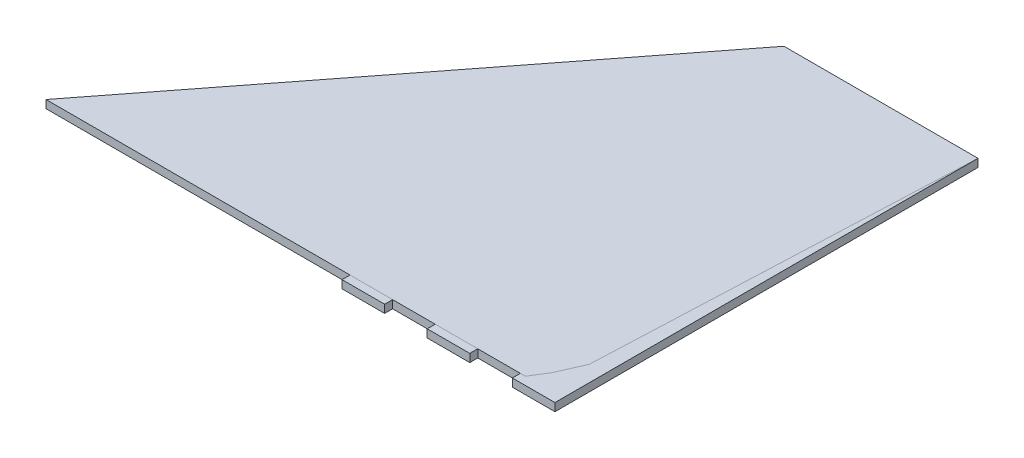
ISO-10303-21;
HEADER;
FILE_DESCRIPTION(('STEP AP214'),'2;1');
FILE_NAME('part.step','',(''),(''),'','','');
FILE_SCHEMA(('AUTOMOTIVE_DESIGN { 1 0 10303 214 1 1 1 1 }'));
ENDSEC;
DATA;
#1=APPLICATION_CONTEXT('core data for automotive mechanical design processes');
#2=APPLICATION_PROTOCOL_DEFINITION('international standard','automotive_design',2000,#1);
#3=PRODUCT_CONTEXT('',#1,'mechanical');
#4=PRODUCT('Part','Part','',(#3));
#5=PRODUCT_RELATED_PRODUCT_CATEGORY('part','',(#4));
#6=PRODUCT_DEFINITION_FORMATION('','',#4);
#7=PRODUCT_DEFINITION_CONTEXT('part definition',#1,'design');
#8=PRODUCT_DEFINITION('design','',#6,#7);
#9=PRODUCT_DEFINITION_SHAPE('','',#8);
#10=(LENGTH_UNIT() NAMED_UNIT(*) SI_UNIT(.MILLI.,.METRE.));
#11=(NAMED_UNIT(*) PLANE_ANGLE_UNIT() SI_UNIT($,.RADIAN.));
#12=(NAMED_UNIT(*) SI_UNIT($,.STERADIAN.) SOLID_ANGLE_UNIT());
#13=UNCERTAINTY_MEASURE_WITH_UNIT(LENGTH_MEASURE(1.E-05),#10,'distance_accuracy_value','');
#14=(GEOMETRIC_REPRESENTATION_CONTEXT(3) GLOBAL_UNCERTAINTY_ASSIGNED_CONTEXT((#13)) GLOBAL_UNIT_ASSIGNED_CONTEXT((#10,
#11,#12)) REPRESENTATION_CONTEXT('',''));
#15=CARTESIAN_POINT('',(0.,0.,0.));
#16=DIRECTION('',(0.,0.,1.));
#17=DIRECTION('',(1.,0.,0.));
#18=AXIS2_PLACEMENT_3D('',#15,#16,#17);
#19=CARTESIAN_POINT('',(0.,0.,0.));
#20=DIRECTION('',(0.,1.,0.));
#21=DIRECTION('',(0.,0.,1.));
#22=AXIS2_PLACEMENT_3D('',#19,#20,#21);
#23=PLANE('',#22);
#24=DIRECTION('',(-1.,0.,0.));
#25=VECTOR('',#24,1.);
#26=CARTESIAN_POINT('',(288.925,0.,9.52500000000002));
#27=LINE('',#26,#25);
#28=CARTESIAN_POINT('',(288.925,0.,9.52500000000002));
#29=VERTEX_POINT('',#28);
#30=CARTESIAN_POINT('',(-19.4751899156325,0.,9.52499999999998));
#31=VERTEX_POINT('',#30);
#32=EDGE_CURVE('E139',#29,#31,#27,.T.);
#33=ORIENTED_EDGE('',*,*,#32,.T.);
#34=DIRECTION('',(0.61394061351492,0.,-0.789352217376326));
#35=VECTOR('',#34,1.);
#36=CARTESIAN_POINT('',(-19.4751899156325,0.,9.52499999999998));
#37=LINE('',#36,#35);
#38=CARTESIAN_POINT('',(173.141476751034,0.,-238.125));
#39=VERTEX_POINT('',#38);
#40=EDGE_CURVE('E150',#31,#39,#37,.T.);
#41=ORIENTED_EDGE('',*,*,#40,.T.);
#42=DIRECTION('',(1.,0.,0.));
#43=VECTOR('',#42,1.);
#44=CARTESIAN_POINT('',(173.141476751034,0.,-238.125));
#45=LINE('',#44,#43);
#46=CARTESIAN_POINT('',(288.925,0.,-238.125));
#47=VERTEX_POINT('',#46);
#48=EDGE_CURVE('E135',#39,#47,#45,.T.);
#49=ORIENTED_EDGE('',*,*,#48,.T.);
#50=DIRECTION('',(0.,0.,1.));
#51=VECTOR('',#50,1.);
#52=CARTESIAN_POINT('',(288.925,0.,-238.125));
#53=LINE('',#52,#51);
#54=EDGE_CURVE('E13',#47,#29,#53,.T.);
#55=ORIENTED_EDGE('',*,*,#54,.T.);
#56=EDGE_LOOP('',(#33,#41,#49,#55));
#57=FACE_BOUND('',#56,.T.);
#58=ADVANCED_FACE('F130',(#57),#23,.F.);
#59=OPEN_SHELL('',(#58));
#60=SHELL_BASED_SURFACE_MODEL('B2',(#59));
#61=CARTESIAN_POINT('',(0.,4.7625,0.));
#62=DIRECTION('',(0.,1.,0.));
#63=DIRECTION('',(0.,0.,1.));
#64=AXIS2_PLACEMENT_3D('',#61,#62,#63);
#65=PLANE('',#64);
#66=DIRECTION('',(-0.61394061351492,0.,0.789352217376326));
#67=VECTOR('',#66,1.);
#68=CARTESIAN_POINT('',(173.141476751034,4.7625,-238.125));
#69=LINE('',#68,#67);
#70=CARTESIAN_POINT('',(173.141476751034,4.7625,-238.125));
#71=VERTEX_POINT('',#70);
#72=CARTESIAN_POINT('',(-19.4751899156325,4.7625,9.52499999999998));
#73=VERTEX_POINT('',#72);
#74=EDGE_CURVE('E192',#71,#73,#69,.T.);
#75=ORIENTED_EDGE('',*,*,#74,.T.);
#76=DIRECTION('',(1.,0.,0.));
#77=VECTOR('',#76,1.);
#78=CARTESIAN_POINT('',(-19.4751899156325,4.7625,9.52499999999998));
#79=LINE('',#78,#77);
#80=CARTESIAN_POINT('',(288.925,4.7625,9.52499999999998));
#81=VERTEX_POINT('',#80);
#82=EDGE_CURVE('E203',#73,#81,#79,.T.);
#83=ORIENTED_EDGE('',*,*,#82,.T.);
#84=DIRECTION('',(0.,0.,-1.));
#85=VECTOR('',#84,1.);
#86=CARTESIAN_POINT('',(288.925,4.7625,9.52499999999998));
#87=LINE('',#86,#85);
#88=CARTESIAN_POINT('',(288.925,4.7625,-238.125));
#89=VERTEX_POINT('',#88);
#90=EDGE_CURVE('E188',#81,#89,#87,.T.);
#91=ORIENTED_EDGE('',*,*,#90,.T.);
#92=DIRECTION('',(-1.,0.,0.));
#93=VECTOR('',#92,1.);
#94=CARTESIAN_POINT('',(288.925,4.7625,-238.125));
#95=LINE('',#94,#93);
#96=EDGE_CURVE('E128',#89,#71,#95,.T.);
#97=ORIENTED_EDGE('',*,*,#96,.T.);
#98=EDGE_LOOP('',(#75,#83,#91,#97));
#99=FACE_BOUND('',#98,.T.);
#100=ADVANCED_FACE('F183',(#99),#65,.T.);
#101=OPEN_SHELL('',(#100));
#102=SHELL_BASED_SURFACE_MODEL('B7',(#101));
#103=CARTESIAN_POINT('',(0.,4.7625,-238.125));
#104=DIRECTION('',(0.,0.,-1.));
#105=DIRECTION('',(-1.,0.,0.));
#106=AXIS2_PLACEMENT_3D('',#103,#104,#105);
#107=PLANE('',#106);
#108=DIRECTION('',(1.,0.,0.));
#109=VECTOR('',#108,1.);
#110=CARTESIAN_POINT('',(0.,0.,-238.125));
#111=LINE('',#110,#109);
#112=CARTESIAN_POINT('',(173.141476751034,0.,-238.125));
#113=VERTEX_POINT('',#112);
#114=CARTESIAN_POINT('',(288.925,0.,-238.125));
#115=VERTEX_POINT('',#114);
#116=EDGE_CURVE('E445',#113,#115,#111,.T.);
#117=ORIENTED_EDGE('',*,*,#116,.F.);
#118=DIRECTION('',(0.,-1.,0.));
#119=VECTOR('',#118,1.);
#120=CARTESIAN_POINT('',(173.141476751034,4.7625,-238.125));
#121=LINE('',#120,#119);
#122=CARTESIAN_POINT('',(173.141476751034,4.7625,-238.125));
#123=VERTEX_POINT('',#122);
#124=EDGE_CURVE('E325',#123,#113,#121,.T.);
#125=ORIENTED_EDGE('',*,*,#124,.F.);
#126=DIRECTION('',(1.,0.,0.));
#127=VECTOR('',#126,1.);
#128=CARTESIAN_POINT('',(0.,4.7625,-238.125));
#129=LINE('',#128,#127);
#130=CARTESIAN_POINT('',(288.925,4.7625,-238.125));
#131=VERTEX_POINT('',#130);
#132=EDGE_CURVE('E412',#123,#131,#129,.T.);
#133=ORIENTED_EDGE('',*,*,#132,.T.);
#134=DIRECTION('',(0.,-1.,0.));
#135=VECTOR('',#134,1.);
#136=CARTESIAN_POINT('',(288.925,4.7625,-238.125));
#137=LINE('',#136,#135);
#138=EDGE_CURVE('E320',#131,#115,#137,.T.);
#139=ORIENTED_EDGE('',*,*,#138,.T.);
#140=EDGE_LOOP('',(#117,#125,#133,#139));
#141=FACE_BOUND('',#140,.T.);
#142=ADVANCED_FACE('F227',(#141),#107,.T.);
#143=CARTESIAN_POINT('',(288.925,4.7625,0.));
#144=DIRECTION('',(-1.,0.,0.));
#145=DIRECTION('',(0.,0.,1.));
#146=AXIS2_PLACEMENT_3D('',#143,#144,#145);
#147=PLANE('',#146);
#148=DIRECTION('',(0.,0.,-1.));
#149=VECTOR('',#148,1.);
#150=CARTESIAN_POINT('',(288.925,0.,0.));
#151=LINE('',#150,#149);
#152=CARTESIAN_POINT('',(288.925,0.,14.2874999999999));
#153=VERTEX_POINT('',#152);
#154=EDGE_CURVE('E287',#153,#115,#151,.T.);
#155=ORIENTED_EDGE('',*,*,#154,.T.);
#156=ORIENTED_EDGE('',*,*,#138,.F.);
#157=DIRECTION('',(0.,0.,-1.));
#158=VECTOR('',#157,1.);
#159=CARTESIAN_POINT('',(288.925,4.7625,0.));
#160=LINE('',#159,#158);
#161=CARTESIAN_POINT('',(288.925,4.7625,14.2874999999999));
#162=VERTEX_POINT('',#161);
#163=EDGE_CURVE('E406',#162,#131,#160,.T.);
#164=ORIENTED_EDGE('',*,*,#163,.F.);
#165=DIRECTION('',(0.,-1.,0.));
#166=VECTOR('',#165,1.);
#167=CARTESIAN_POINT('',(288.925,4.7625,14.2874999999999));
#168=LINE('',#167,#166);
#169=EDGE_CURVE('E231',#162,#153,#168,.T.);
#170=ORIENTED_EDGE('',*,*,#169,.T.);
#171=EDGE_LOOP('',(#155,#156,#164,#170));
#172=FACE_BOUND('',#171,.T.);
#173=ADVANCED_FACE('F404',(#172),#147,.F.);
#174=CARTESIAN_POINT('',(0.,4.7625,0.));
#175=DIRECTION('',(0.,0.,-1.));
#176=DIRECTION('',(-1.,0.,0.));
#177=AXIS2_PLACEMENT_3D('',#174,#175,#176);
#178=PLANE('',#177);
#179=DIRECTION('',(1.,0.,0.));
#180=VECTOR('',#179,1.);
#181=CARTESIAN_POINT('',(0.,0.,0.));
#182=LINE('',#181,#180);
#183=CARTESIAN_POINT('',(0.,0.,0.));
#184=VERTEX_POINT('',#183);
#185=CARTESIAN_POINT('',(272.451083662066,0.,0.));
#186=VERTEX_POINT('',#185);
#187=EDGE_CURVE('E441',#184,#186,#182,.T.);
#188=ORIENTED_EDGE('',*,*,#187,.F.);
#189=DIRECTION('',(0.,-1.,0.));
#190=VECTOR('',#189,1.);
#191=CARTESIAN_POINT('',(0.,4.7625,0.));
#192=LINE('',#191,#190);
#193=CARTESIAN_POINT('',(0.,4.7625,0.));
#194=VERTEX_POINT('',#193);
#195=EDGE_CURVE('E337',#194,#184,#192,.T.);
#196=ORIENTED_EDGE('',*,*,#195,.F.);
#197=DIRECTION('',(1.,0.,0.));
#198=VECTOR('',#197,1.);
#199=CARTESIAN_POINT('',(0.,4.7625,0.));
#200=LINE('',#199,#198);
#201=CARTESIAN_POINT('',(272.451083662066,4.7625,0.));
#202=VERTEX_POINT('',#201);
#203=EDGE_CURVE('E415',#194,#202,#200,.T.);
#204=ORIENTED_EDGE('',*,*,#203,.T.);
#205=DIRECTION('',(0.,-1.,0.));
#206=VECTOR('',#205,1.);
#207=CARTESIAN_POINT('',(272.451083662066,4.7625,0.));
#208=LINE('',#207,#206);
#209=EDGE_CURVE('E340',#202,#186,#208,.T.);
#210=ORIENTED_EDGE('',*,*,#209,.T.);
#211=EDGE_LOOP('',(#188,#196,#204,#210));
#212=FACE_BOUND('',#211,.T.);
#213=ADVANCED_FACE('F558',(#212),#178,.T.);
#214=CARTESIAN_POINT('',(227.510698728117,4.7625,-101.115866101385));
#215=DIRECTION('',(0.913811548620257,0.,-0.406138466053448));
#216=DIRECTION('',(-0.406138466053448,0.,-0.913811548620257));
#217=AXIS2_PLACEMENT_3D('',#214,#215,#216);
#218=PLANE('',#217);
#219=DIRECTION('',(0.406138466053448,0.,0.913811548620257));
#220=VECTOR('',#219,1.);
#221=CARTESIAN_POINT('',(227.510698728117,0.,-101.115866101385));
#222=LINE('',#221,#220);
#223=CARTESIAN_POINT('',(173.377962330406,0.,-222.914522996236));
#224=VERTEX_POINT('',#223);
#225=EDGE_CURVE('E438',#224,#186,#222,.T.);
#226=ORIENTED_EDGE('',*,*,#225,.T.);
#227=ORIENTED_EDGE('',*,*,#209,.F.);
#228=DIRECTION('',(0.406138466053448,0.,0.913811548620257));
#229=VECTOR('',#228,1.);
#230=CARTESIAN_POINT('',(227.510698728117,4.7625,-101.115866101385));
#231=LINE('',#230,#229);
#232=CARTESIAN_POINT('',(173.377962330406,4.7625,-222.914522996236));
#233=VERTEX_POINT('',#232);
#234=EDGE_CURVE('E593',#233,#202,#231,.T.);
#235=ORIENTED_EDGE('',*,*,#234,.F.);
#236=DIRECTION('',(0.,-1.,0.));
#237=VECTOR('',#236,1.);
#238=CARTESIAN_POINT('',(173.377962330406,4.7625,-222.914522996236));
#239=LINE('',#238,#237);
#240=EDGE_CURVE('E344',#233,#224,#239,.T.);
#241=ORIENTED_EDGE('',*,*,#240,.T.);
#242=EDGE_LOOP('',(#226,#227,#235,#241));
#243=FACE_BOUND('',#242,.T.);
#244=ADVANCED_FACE('F554',(#243),#218,.F.);
#245=CARTESIAN_POINT('',(0.,4.7625,0.));
#246=DIRECTION('',(-0.789352217376326,0.,-0.61394061351492));
#247=DIRECTION('',(-0.61394061351492,0.,0.789352217376327));
#248=AXIS2_PLACEMENT_3D('',#245,#246,#247);
#249=PLANE('',#248);
#250=DIRECTION('',(0.61394061351492,0.,-0.789352217376327));
#251=VECTOR('',#250,1.);
#252=CARTESIAN_POINT('',(0.,0.,0.));
#253=LINE('',#252,#251);
#254=EDGE_CURVE('E435',#184,#224,#253,.T.);
#255=ORIENTED_EDGE('',*,*,#254,.T.);
#256=ORIENTED_EDGE('',*,*,#240,.F.);
#257=DIRECTION('',(0.61394061351492,0.,-0.789352217376327));
#258=VECTOR('',#257,1.);
#259=CARTESIAN_POINT('',(0.,4.7625,0.));
#260=LINE('',#259,#258);
#261=EDGE_CURVE('E589',#194,#233,#260,.T.);
#262=ORIENTED_EDGE('',*,*,#261,.F.);
#263=ORIENTED_EDGE('',*,*,#195,.T.);
#264=EDGE_LOOP('',(#255,#256,#262,#263));
#265=FACE_BOUND('',#264,.T.);
#266=ADVANCED_FACE('F550',(#265),#249,.F.);
#267=CARTESIAN_POINT('',(279.4,4.7625,0.));
#268=DIRECTION('',(-1.,0.,0.));
#269=DIRECTION('',(0.,0.,1.));
#270=AXIS2_PLACEMENT_3D('',#267,#268,#269);
#271=PLANE('',#270);
#272=DIRECTION('',(0.,0.,-1.));
#273=VECTOR('',#272,1.);
#274=CARTESIAN_POINT('',(279.4,0.,0.));
#275=LINE('',#274,#273);
#276=CARTESIAN_POINT('',(279.4,0.,-15.6350617603514));
#277=VERTEX_POINT('',#276);
#278=CARTESIAN_POINT('',(279.4,0.,-228.6));
#279=VERTEX_POINT('',#278);
#280=EDGE_CURVE('E432',#277,#279,#275,.T.);
#281=ORIENTED_EDGE('',*,*,#280,.F.);
#282=DIRECTION('',(0.,-1.,0.));
#283=VECTOR('',#282,1.);
#284=CARTESIAN_POINT('',(279.4,4.7625,-15.6350617603514));
#285=LINE('',#284,#283);
#286=CARTESIAN_POINT('',(279.4,4.7625,-15.6350617603514));
#287=VERTEX_POINT('',#286);
#288=EDGE_CURVE('E347',#287,#277,#285,.T.);
#289=ORIENTED_EDGE('',*,*,#288,.F.);
#290=DIRECTION('',(0.,0.,-1.));
#291=VECTOR('',#290,1.);
#292=CARTESIAN_POINT('',(279.4,4.7625,0.));
#293=LINE('',#292,#291);
#294=CARTESIAN_POINT('',(279.4,4.7625,-228.6));
#295=VERTEX_POINT('',#294);
#296=EDGE_CURVE('E598',#287,#295,#293,.T.);
#297=ORIENTED_EDGE('',*,*,#296,.T.);
#298=DIRECTION('',(0.,-1.,0.));
#299=VECTOR('',#298,1.);
#300=CARTESIAN_POINT('',(279.4,4.7625,-228.6));
#301=LINE('',#300,#299);
#302=EDGE_CURVE('E350',#295,#279,#301,.T.);
#303=ORIENTED_EDGE('',*,*,#302,.T.);
#304=EDGE_LOOP('',(#281,#289,#297,#303));
#305=FACE_BOUND('',#304,.T.);
#306=ADVANCED_FACE('F546',(#305),#271,.T.);
#307=CARTESIAN_POINT('',(1.87350135405495E-13,4.7625,-228.6));
#308=DIRECTION('',(0.,0.,1.));
#309=DIRECTION('',(1.,0.,0.));
#310=AXIS2_PLACEMENT_3D('',#307,#308,#309);
#311=PLANE('',#310);
#312=DIRECTION('',(-1.,0.,0.));
#313=VECTOR('',#312,1.);
#314=CARTESIAN_POINT('',(1.87350135405495E-13,0.,-228.6));
#315=LINE('',#314,#313);
#316=CARTESIAN_POINT('',(184.748916337934,0.,-228.6));
#317=VERTEX_POINT('',#316);
#318=EDGE_CURVE('E429',#279,#317,#315,.T.);
#319=ORIENTED_EDGE('',*,*,#318,.F.);
#320=ORIENTED_EDGE('',*,*,#302,.F.);
#321=DIRECTION('',(-1.,0.,0.));
#322=VECTOR('',#321,1.);
#323=CARTESIAN_POINT('',(1.87350135405495E-13,4.7625,-228.6));
#324=LINE('',#323,#322);
#325=CARTESIAN_POINT('',(184.748916337934,4.7625,-228.6));
#326=VERTEX_POINT('',#325);
#327=EDGE_CURVE('E510',#295,#326,#324,.T.);
#328=ORIENTED_EDGE('',*,*,#327,.T.);
#329=DIRECTION('',(0.,-1.,0.));
#330=VECTOR('',#329,1.);
#331=CARTESIAN_POINT('',(184.748916337934,4.7625,-228.6));
#332=LINE('',#331,#330);
#333=EDGE_CURVE('E341',#326,#317,#332,.T.);
#334=ORIENTED_EDGE('',*,*,#333,.T.);
#335=EDGE_LOOP('',(#319,#320,#328,#334));
#336=FACE_BOUND('',#335,.T.);
#337=ADVANCED_FACE('F542',(#336),#311,.T.);
#338=CARTESIAN_POINT('',(239.116105395594,4.7625,-106.273824620264));
#339=DIRECTION('',(0.913811548620257,0.,-0.406138466053447));
#340=DIRECTION('',(-0.406138466053447,0.,-0.913811548620257));
#341=AXIS2_PLACEMENT_3D('',#338,#339,#340);
#342=PLANE('',#341);
#343=DIRECTION('',(0.406138466053447,0.,0.913811548620257));
#344=VECTOR('',#343,1.);
#345=CARTESIAN_POINT('',(239.116105395594,0.,-106.273824620264));
#346=LINE('',#345,#344);
#347=EDGE_CURVE('E379',#317,#277,#346,.T.);
#348=ORIENTED_EDGE('',*,*,#347,.F.);
#349=ORIENTED_EDGE('',*,*,#333,.F.);
#350=DIRECTION('',(0.406138466053447,0.,0.913811548620257));
#351=VECTOR('',#350,1.);
#352=CARTESIAN_POINT('',(239.116105395594,4.7625,-106.273824620264));
#353=LINE('',#352,#351);
#354=EDGE_CURVE('E508',#326,#287,#353,.T.);
#355=ORIENTED_EDGE('',*,*,#354,.T.);
#356=ORIENTED_EDGE('',*,*,#288,.T.);
#357=EDGE_LOOP('',(#348,#349,#355,#356));
#358=FACE_BOUND('',#357,.T.);
#359=ADVANCED_FACE('F539',(#358),#342,.T.);
#360=CARTESIAN_POINT('',(-7.51857987050951,4.7625,-5.84778434372962));
#361=DIRECTION('',(0.789352217376326,0.,0.61394061351492));
#362=DIRECTION('',(0.61394061351492,0.,-0.789352217376327));
#363=AXIS2_PLACEMENT_3D('',#360,#361,#362);
#364=PLANE('',#363);
#365=DIRECTION('',(-0.61394061351492,0.,0.789352217376327));
#366=VECTOR('',#365,1.);
#367=CARTESIAN_POINT('',(-7.51857987050951,0.,-5.84778434372962));
#368=LINE('',#367,#366);
#369=CARTESIAN_POINT('',(-19.4751899156325,0.,9.52499999999998));
#370=VERTEX_POINT('',#369);
#371=EDGE_CURVE('E447',#113,#370,#368,.T.);
#372=ORIENTED_EDGE('',*,*,#371,.T.);
#373=DIRECTION('',(0.,-1.,0.));
#374=VECTOR('',#373,1.);
#375=CARTESIAN_POINT('',(-19.4751899156325,4.7625,9.52499999999998));
#376=LINE('',#375,#374);
#377=CARTESIAN_POINT('',(-19.4751899156325,4.7625,9.52499999999998));
#378=VERTEX_POINT('',#377);
#379=EDGE_CURVE('E333',#378,#370,#376,.T.);
#380=ORIENTED_EDGE('',*,*,#379,.F.);
#381=DIRECTION('',(-0.61394061351492,0.,0.789352217376327));
#382=VECTOR('',#381,1.);
#383=CARTESIAN_POINT('',(-7.51857987050951,4.7625,-5.84778434372962));
#384=LINE('',#383,#382);
#385=EDGE_CURVE('E419',#123,#378,#384,.T.);
#386=ORIENTED_EDGE('',*,*,#385,.F.);
#387=ORIENTED_EDGE('',*,*,#124,.T.);
#388=EDGE_LOOP('',(#372,#380,#386,#387));
#389=FACE_BOUND('',#388,.T.);
#390=ADVANCED_FACE('F466',(#389),#364,.F.);
#391=CARTESIAN_POINT('',(0.,0.,0.));
#392=DIRECTION('',(0.,1.,0.));
#393=DIRECTION('',(0.,0.,1.));
#394=AXIS2_PLACEMENT_3D('',#391,#392,#393);
#395=PLANE('',#394);
#396=ORIENTED_EDGE('',*,*,#347,.T.);
#397=ORIENTED_EDGE('',*,*,#280,.T.);
#398=ORIENTED_EDGE('',*,*,#318,.T.);
#399=EDGE_LOOP('',(#396,#397,#398));
#400=FACE_BOUND('',#399,.T.);
#401=ORIENTED_EDGE('',*,*,#254,.F.);
#402=ORIENTED_EDGE('',*,*,#187,.T.);
#403=ORIENTED_EDGE('',*,*,#225,.F.);
#404=EDGE_LOOP('',(#401,#402,#403));
#405=FACE_BOUND('',#404,.T.);
#406=ORIENTED_EDGE('',*,*,#154,.F.);
#407=DIRECTION('',(-1.,0.,0.));
#408=VECTOR('',#407,1.);
#409=CARTESIAN_POINT('',(288.925,0.,14.2874999999999));
#410=LINE('',#409,#408);
#411=CARTESIAN_POINT('',(263.525,0.,14.2874999999999));
#412=VERTEX_POINT('',#411);
#413=EDGE_CURVE('E297',#153,#412,#410,.T.);
#414=ORIENTED_EDGE('',*,*,#413,.T.);
#415=DIRECTION('',(0.,0.,1.));
#416=VECTOR('',#415,1.);
#417=CARTESIAN_POINT('',(263.525,0.,9.52499999999994));
#418=LINE('',#417,#416);
#419=CARTESIAN_POINT('',(263.525,0.,9.52499999999994));
#420=VERTEX_POINT('',#419);
#421=EDGE_CURVE('E305',#420,#412,#418,.T.);
#422=ORIENTED_EDGE('',*,*,#421,.F.);
#423=DIRECTION('',(-1.,0.,0.));
#424=VECTOR('',#423,1.);
#425=CARTESIAN_POINT('',(0.,0.,9.52499999999997));
#426=LINE('',#425,#424);
#427=CARTESIAN_POINT('',(238.125,0.,9.52499999999994));
#428=VERTEX_POINT('',#427);
#429=EDGE_CURVE('E453',#420,#428,#426,.T.);
#430=ORIENTED_EDGE('',*,*,#429,.T.);
#431=DIRECTION('',(0.,0.,1.));
#432=VECTOR('',#431,1.);
#433=CARTESIAN_POINT('',(238.125,0.,9.52499999999994));
#434=LINE('',#433,#432);
#435=CARTESIAN_POINT('',(238.125,0.,14.2874999999999));
#436=VERTEX_POINT('',#435);
#437=EDGE_CURVE('E302',#428,#436,#434,.T.);
#438=ORIENTED_EDGE('',*,*,#437,.T.);
#439=DIRECTION('',(-1.,0.,0.));
#440=VECTOR('',#439,1.);
#441=CARTESIAN_POINT('',(238.125,0.,14.2874999999999));
#442=LINE('',#441,#440);
#443=CARTESIAN_POINT('',(212.725,0.,14.2874999999999));
#444=VERTEX_POINT('',#443);
#445=EDGE_CURVE('E393',#436,#444,#442,.T.);
#446=ORIENTED_EDGE('',*,*,#445,.T.);
#447=DIRECTION('',(0.,0.,1.));
#448=VECTOR('',#447,1.);
#449=CARTESIAN_POINT('',(212.725,0.,9.52499999999995));
#450=LINE('',#449,#448);
#451=CARTESIAN_POINT('',(212.725,0.,9.52499999999995));
#452=VERTEX_POINT('',#451);
#453=EDGE_CURVE('E385',#452,#444,#450,.T.);
#454=ORIENTED_EDGE('',*,*,#453,.F.);
#455=CARTESIAN_POINT('',(187.325,0.,9.52499999999995));
#456=VERTEX_POINT('',#455);
#457=EDGE_CURVE('E452',#452,#456,#426,.T.);
#458=ORIENTED_EDGE('',*,*,#457,.T.);
#459=DIRECTION('',(0.,0.,1.));
#460=VECTOR('',#459,1.);
#461=CARTESIAN_POINT('',(187.325,0.,9.52499999999995));
#462=LINE('',#461,#460);
#463=CARTESIAN_POINT('',(187.325,0.,14.2875));
#464=VERTEX_POINT('',#463);
#465=EDGE_CURVE('E366',#456,#464,#462,.T.);
#466=ORIENTED_EDGE('',*,*,#465,.T.);
#467=DIRECTION('',(-1.,0.,0.));
#468=VECTOR('',#467,1.);
#469=CARTESIAN_POINT('',(187.325,0.,14.2875));
#470=LINE('',#469,#468);
#471=CARTESIAN_POINT('',(161.925,0.,14.2875));
#472=VERTEX_POINT('',#471);
#473=EDGE_CURVE('E369',#464,#472,#470,.T.);
#474=ORIENTED_EDGE('',*,*,#473,.T.);
#475=DIRECTION('',(0.,0.,1.));
#476=VECTOR('',#475,1.);
#477=CARTESIAN_POINT('',(161.925,0.,9.52499999999996));
#478=LINE('',#477,#476);
#479=CARTESIAN_POINT('',(161.925,0.,9.52499999999995));
#480=VERTEX_POINT('',#479);
#481=EDGE_CURVE('E360',#480,#472,#478,.T.);
#482=ORIENTED_EDGE('',*,*,#481,.F.);
#483=EDGE_CURVE('E450',#480,#370,#426,.T.);
#484=ORIENTED_EDGE('',*,*,#483,.T.);
#485=ORIENTED_EDGE('',*,*,#371,.F.);
#486=ORIENTED_EDGE('',*,*,#116,.T.);
#487=EDGE_LOOP('',(#406,#414,#422,#430,#438,#446,#454,#458,#466,#474,#482,#484,#485,#486));
#488=FACE_BOUND('',#487,.T.);
#489=ADVANCED_FACE('F313',(#400,#405,#488),#395,.F.);
#490=CARTESIAN_POINT('',(0.,4.7625,0.));
#491=DIRECTION('',(0.,1.,0.));
#492=DIRECTION('',(0.,0.,1.));
#493=AXIS2_PLACEMENT_3D('',#490,#491,#492);
#494=PLANE('',#493);
#495=ORIENTED_EDGE('',*,*,#354,.F.);
#496=ORIENTED_EDGE('',*,*,#327,.F.);
#497=ORIENTED_EDGE('',*,*,#296,.F.);
#498=EDGE_LOOP('',(#495,#496,#497));
#499=FACE_BOUND('',#498,.T.);
#500=ORIENTED_EDGE('',*,*,#261,.T.);
#501=ORIENTED_EDGE('',*,*,#234,.T.);
#502=ORIENTED_EDGE('',*,*,#203,.F.);
#503=EDGE_LOOP('',(#500,#501,#502));
#504=FACE_BOUND('',#503,.T.);
#505=ORIENTED_EDGE('',*,*,#163,.T.);
#506=ORIENTED_EDGE('',*,*,#132,.F.);
#507=ORIENTED_EDGE('',*,*,#385,.T.);
#508=DIRECTION('',(-1.,0.,0.));
#509=VECTOR('',#508,1.);
#510=CARTESIAN_POINT('',(0.,4.7625,9.52499999999997));
#511=LINE('',#510,#509);
#512=CARTESIAN_POINT('',(161.925,4.7625,9.52499999999995));
#513=VERTEX_POINT('',#512);
#514=EDGE_CURVE('E421',#513,#378,#511,.T.);
#515=ORIENTED_EDGE('',*,*,#514,.F.);
#516=DIRECTION('',(0.,0.,1.));
#517=VECTOR('',#516,1.);
#518=CARTESIAN_POINT('',(161.925,4.7625,9.52499999999996));
#519=LINE('',#518,#517);
#520=CARTESIAN_POINT('',(161.925,4.7625,14.2875));
#521=VERTEX_POINT('',#520);
#522=EDGE_CURVE('E363',#513,#521,#519,.T.);
#523=ORIENTED_EDGE('',*,*,#522,.T.);
#524=DIRECTION('',(-1.,0.,0.));
#525=VECTOR('',#524,1.);
#526=CARTESIAN_POINT('',(187.325,4.7625,14.2875));
#527=LINE('',#526,#525);
#528=CARTESIAN_POINT('',(187.325,4.7625,14.2875));
#529=VERTEX_POINT('',#528);
#530=EDGE_CURVE('E359',#529,#521,#527,.T.);
#531=ORIENTED_EDGE('',*,*,#530,.F.);
#532=DIRECTION('',(0.,0.,1.));
#533=VECTOR('',#532,1.);
#534=CARTESIAN_POINT('',(187.325,4.7625,9.52499999999995));
#535=LINE('',#534,#533);
#536=CARTESIAN_POINT('',(187.325,4.7625,9.52499999999995));
#537=VERTEX_POINT('',#536);
#538=EDGE_CURVE('E356',#537,#529,#535,.T.);
#539=ORIENTED_EDGE('',*,*,#538,.F.);
#540=CARTESIAN_POINT('',(212.725,4.7625,9.52499999999995));
#541=VERTEX_POINT('',#540);
#542=EDGE_CURVE('E426',#541,#537,#511,.T.);
#543=ORIENTED_EDGE('',*,*,#542,.F.);
#544=DIRECTION('',(0.,0.,1.));
#545=VECTOR('',#544,1.);
#546=CARTESIAN_POINT('',(212.725,4.7625,9.52499999999995));
#547=LINE('',#546,#545);
#548=CARTESIAN_POINT('',(212.725,4.7625,14.2874999999999));
#549=VERTEX_POINT('',#548);
#550=EDGE_CURVE('E388',#541,#549,#547,.T.);
#551=ORIENTED_EDGE('',*,*,#550,.T.);
#552=DIRECTION('',(-1.,0.,0.));
#553=VECTOR('',#552,1.);
#554=CARTESIAN_POINT('',(238.125,4.7625,14.2874999999999));
#555=LINE('',#554,#553);
#556=CARTESIAN_POINT('',(238.125,4.7625,14.2874999999999));
#557=VERTEX_POINT('',#556);
#558=EDGE_CURVE('E384',#557,#549,#555,.T.);
#559=ORIENTED_EDGE('',*,*,#558,.F.);
#560=DIRECTION('',(0.,0.,1.));
#561=VECTOR('',#560,1.);
#562=CARTESIAN_POINT('',(238.125,4.7625,9.52499999999994));
#563=LINE('',#562,#561);
#564=CARTESIAN_POINT('',(238.125,4.7625,9.52499999999994));
#565=VERTEX_POINT('',#564);
#566=EDGE_CURVE('E381',#565,#557,#563,.T.);
#567=ORIENTED_EDGE('',*,*,#566,.F.);
#568=CARTESIAN_POINT('',(263.525,4.7625,9.52499999999994));
#569=VERTEX_POINT('',#568);
#570=EDGE_CURVE('E351',#569,#565,#511,.T.);
#571=ORIENTED_EDGE('',*,*,#570,.F.);
#572=DIRECTION('',(0.,0.,1.));
#573=VECTOR('',#572,1.);
#574=CARTESIAN_POINT('',(263.525,4.7625,9.52499999999994));
#575=LINE('',#574,#573);
#576=CARTESIAN_POINT('',(263.525,4.7625,14.2874999999999));
#577=VERTEX_POINT('',#576);
#578=EDGE_CURVE('E316',#569,#577,#575,.T.);
#579=ORIENTED_EDGE('',*,*,#578,.T.);
#580=DIRECTION('',(-1.,0.,0.));
#581=VECTOR('',#580,1.);
#582=CARTESIAN_POINT('',(288.925,4.7625,14.2874999999999));
#583=LINE('',#582,#581);
#584=EDGE_CURVE('E299',#162,#577,#583,.T.);
#585=ORIENTED_EDGE('',*,*,#584,.F.);
#586=EDGE_LOOP('',(#505,#506,#507,#515,#523,#531,#539,#543,#551,#559,#567,#571,#579,#585));
#587=FACE_BOUND('',#586,.T.);
#588=ADVANCED_FACE('F407',(#499,#504,#587),#494,.T.);
#589=CARTESIAN_POINT('',(0.,4.7625,9.52499999999997));
#590=DIRECTION('',(0.,0.,1.));
#591=DIRECTION('',(1.,0.,0.));
#592=AXIS2_PLACEMENT_3D('',#589,#590,#591);
#593=PLANE('',#592);
#594=ORIENTED_EDGE('',*,*,#570,.T.);
#595=DIRECTION('',(0.,-1.,0.));
#596=VECTOR('',#595,1.);
#597=CARTESIAN_POINT('',(238.125,4.7625,9.52499999999994));
#598=LINE('',#597,#596);
#599=EDGE_CURVE('E319',#565,#428,#598,.T.);
#600=ORIENTED_EDGE('',*,*,#599,.T.);
#601=ORIENTED_EDGE('',*,*,#429,.F.);
#602=DIRECTION('',(0.,-1.,0.));
#603=VECTOR('',#602,1.);
#604=CARTESIAN_POINT('',(263.525,4.7625,9.52499999999994));
#605=LINE('',#604,#603);
#606=EDGE_CURVE('E309',#569,#420,#605,.T.);
#607=ORIENTED_EDGE('',*,*,#606,.F.);
#608=EDGE_LOOP('',(#594,#600,#601,#607));
#609=FACE_BOUND('',#608,.T.);
#610=ADVANCED_FACE('F502',(#609),#593,.T.);
#611=ORIENTED_EDGE('',*,*,#542,.T.);
#612=DIRECTION('',(0.,-1.,0.));
#613=VECTOR('',#612,1.);
#614=CARTESIAN_POINT('',(187.325,4.7625,9.52499999999995));
#615=LINE('',#614,#613);
#616=EDGE_CURVE('E237',#537,#456,#615,.T.);
#617=ORIENTED_EDGE('',*,*,#616,.T.);
#618=ORIENTED_EDGE('',*,*,#457,.F.);
#619=DIRECTION('',(0.,-1.,0.));
#620=VECTOR('',#619,1.);
#621=CARTESIAN_POINT('',(212.725,4.7625,9.52499999999995));
#622=LINE('',#621,#620);
#623=EDGE_CURVE('E322',#541,#452,#622,.T.);
#624=ORIENTED_EDGE('',*,*,#623,.F.);
#625=EDGE_LOOP('',(#611,#617,#618,#624));
#626=FACE_BOUND('',#625,.T.);
#627=ADVANCED_FACE('F490',(#626),#593,.T.);
#628=DIRECTION('',(0.,-1.,0.));
#629=VECTOR('',#628,1.);
#630=CARTESIAN_POINT('',(161.925,4.7625,9.52499999999996));
#631=LINE('',#630,#629);
#632=EDGE_CURVE('E181',#513,#480,#631,.T.);
#633=ORIENTED_EDGE('',*,*,#632,.F.);
#634=ORIENTED_EDGE('',*,*,#514,.T.);
#635=ORIENTED_EDGE('',*,*,#379,.T.);
#636=ORIENTED_EDGE('',*,*,#483,.F.);
#637=EDGE_LOOP('',(#633,#634,#635,#636));
#638=FACE_BOUND('',#637,.T.);
#639=ADVANCED_FACE('F457',(#638),#593,.T.);
#640=CARTESIAN_POINT('',(288.925,4.7625,14.2874999999999));
#641=DIRECTION('',(0.,0.,1.));
#642=DIRECTION('',(1.,0.,0.));
#643=AXIS2_PLACEMENT_3D('',#640,#641,#642);
#644=PLANE('',#643);
#645=ORIENTED_EDGE('',*,*,#413,.F.);
#646=ORIENTED_EDGE('',*,*,#169,.F.);
#647=ORIENTED_EDGE('',*,*,#584,.T.);
#648=DIRECTION('',(0.,-1.,0.));
#649=VECTOR('',#648,1.);
#650=CARTESIAN_POINT('',(263.525,4.7625,14.2874999999999));
#651=LINE('',#650,#649);
#652=EDGE_CURVE('E294',#577,#412,#651,.T.);
#653=ORIENTED_EDGE('',*,*,#652,.T.);
#654=EDGE_LOOP('',(#645,#646,#647,#653));
#655=FACE_BOUND('',#654,.T.);
#656=ADVANCED_FACE('F229',(#655),#644,.T.);
#657=CARTESIAN_POINT('',(263.525,4.7625,9.52499999999994));
#658=DIRECTION('',(1.,0.,0.));
#659=DIRECTION('',(0.,0.,-1.));
#660=AXIS2_PLACEMENT_3D('',#657,#658,#659);
#661=PLANE('',#660);
#662=ORIENTED_EDGE('',*,*,#421,.T.);
#663=ORIENTED_EDGE('',*,*,#652,.F.);
#664=ORIENTED_EDGE('',*,*,#578,.F.);
#665=ORIENTED_EDGE('',*,*,#606,.T.);
#666=EDGE_LOOP('',(#662,#663,#664,#665));
#667=FACE_BOUND('',#666,.T.);
#668=ADVANCED_FACE('F306',(#667),#661,.F.);
#669=CARTESIAN_POINT('',(238.125,4.7625,14.2874999999999));
#670=DIRECTION('',(0.,0.,1.));
#671=DIRECTION('',(1.,0.,0.));
#672=AXIS2_PLACEMENT_3D('',#669,#670,#671);
#673=PLANE('',#672);
#674=ORIENTED_EDGE('',*,*,#445,.F.);
#675=DIRECTION('',(0.,-1.,0.));
#676=VECTOR('',#675,1.);
#677=CARTESIAN_POINT('',(238.125,4.7625,14.2874999999999));
#678=LINE('',#677,#676);
#679=EDGE_CURVE('E390',#557,#436,#678,.T.);
#680=ORIENTED_EDGE('',*,*,#679,.F.);
#681=ORIENTED_EDGE('',*,*,#558,.T.);
#682=DIRECTION('',(0.,-1.,0.));
#683=VECTOR('',#682,1.);
#684=CARTESIAN_POINT('',(212.725,4.7625,14.2874999999999));
#685=LINE('',#684,#683);
#686=EDGE_CURVE('E370',#549,#444,#685,.T.);
#687=ORIENTED_EDGE('',*,*,#686,.T.);
#688=EDGE_LOOP('',(#674,#680,#681,#687));
#689=FACE_BOUND('',#688,.T.);
#690=ADVANCED_FACE('F514',(#689),#673,.T.);
#691=CARTESIAN_POINT('',(238.125,4.7625,9.52499999999994));
#692=DIRECTION('',(1.,0.,0.));
#693=DIRECTION('',(0.,0.,-1.));
#694=AXIS2_PLACEMENT_3D('',#691,#692,#693);
#695=PLANE('',#694);
#696=ORIENTED_EDGE('',*,*,#437,.F.);
#697=ORIENTED_EDGE('',*,*,#599,.F.);
#698=ORIENTED_EDGE('',*,*,#566,.T.);
#699=ORIENTED_EDGE('',*,*,#679,.T.);
#700=EDGE_LOOP('',(#696,#697,#698,#699));
#701=FACE_BOUND('',#700,.T.);
#702=ADVANCED_FACE('F506',(#701),#695,.T.);
#703=CARTESIAN_POINT('',(212.725,4.7625,9.52499999999995));
#704=DIRECTION('',(1.,0.,0.));
#705=DIRECTION('',(0.,0.,-1.));
#706=AXIS2_PLACEMENT_3D('',#703,#704,#705);
#707=PLANE('',#706);
#708=ORIENTED_EDGE('',*,*,#453,.T.);
#709=ORIENTED_EDGE('',*,*,#686,.F.);
#710=ORIENTED_EDGE('',*,*,#550,.F.);
#711=ORIENTED_EDGE('',*,*,#623,.T.);
#712=EDGE_LOOP('',(#708,#709,#710,#711));
#713=FACE_BOUND('',#712,.T.);
#714=ADVANCED_FACE('F496',(#713),#707,.F.);
#715=CARTESIAN_POINT('',(187.325,4.7625,14.2875));
#716=DIRECTION('',(0.,0.,1.));
#717=DIRECTION('',(1.,0.,0.));
#718=AXIS2_PLACEMENT_3D('',#715,#716,#717);
#719=PLANE('',#718);
#720=ORIENTED_EDGE('',*,*,#473,.F.);
#721=DIRECTION('',(0.,-1.,0.));
#722=VECTOR('',#721,1.);
#723=CARTESIAN_POINT('',(187.325,4.7625,14.2875));
#724=LINE('',#723,#722);
#725=EDGE_CURVE('E365',#529,#464,#724,.T.);
#726=ORIENTED_EDGE('',*,*,#725,.F.);
#727=ORIENTED_EDGE('',*,*,#530,.T.);
#728=DIRECTION('',(0.,-1.,0.));
#729=VECTOR('',#728,1.);
#730=CARTESIAN_POINT('',(161.925,4.7625,14.2875));
#731=LINE('',#730,#729);
#732=EDGE_CURVE('E377',#521,#472,#731,.T.);
#733=ORIENTED_EDGE('',*,*,#732,.T.);
#734=EDGE_LOOP('',(#720,#726,#727,#733));
#735=FACE_BOUND('',#734,.T.);
#736=ADVANCED_FACE('F526',(#735),#719,.T.);
#737=CARTESIAN_POINT('',(187.325,4.7625,9.52499999999995));
#738=DIRECTION('',(1.,0.,0.));
#739=DIRECTION('',(0.,0.,-1.));
#740=AXIS2_PLACEMENT_3D('',#737,#738,#739);
#741=PLANE('',#740);
#742=ORIENTED_EDGE('',*,*,#465,.F.);
#743=ORIENTED_EDGE('',*,*,#616,.F.);
#744=ORIENTED_EDGE('',*,*,#538,.T.);
#745=ORIENTED_EDGE('',*,*,#725,.T.);
#746=EDGE_LOOP('',(#742,#743,#744,#745));
#747=FACE_BOUND('',#746,.T.);
#748=ADVANCED_FACE('F517',(#747),#741,.T.);
#749=CARTESIAN_POINT('',(161.925,4.7625,9.52499999999996));
#750=DIRECTION('',(1.,0.,0.));
#751=DIRECTION('',(0.,0.,-1.));
#752=AXIS2_PLACEMENT_3D('',#749,#750,#751);
#753=PLANE('',#752);
#754=ORIENTED_EDGE('',*,*,#481,.T.);
#755=ORIENTED_EDGE('',*,*,#732,.F.);
#756=ORIENTED_EDGE('',*,*,#522,.F.);
#757=ORIENTED_EDGE('',*,*,#632,.T.);
#758=EDGE_LOOP('',(#754,#755,#756,#757));
#759=FACE_BOUND('',#758,.T.);
#760=ADVANCED_FACE('F525',(#759),#753,.F.);
#761=CLOSED_SHELL('',(#142,#173,#213,#244,#266,#306,#337,#359,#390,#489,#588,#610,#627,#639,
#656,#668,#690,#702,#714,#736,#748,#760));
#762=MANIFOLD_SOLID_BREP('B122',#761);
#763=ADVANCED_BREP_SHAPE_REPRESENTATION('',(#18,#762),#14);
#764=MANIFOLD_SURFACE_SHAPE_REPRESENTATION('',(#18,#60,#102),#14);
#765=SHAPE_REPRESENTATION('',(#18),#14);
#766=SHAPE_DEFINITION_REPRESENTATION(#9,#765);
#767=SHAPE_REPRESENTATION_RELATIONSHIP('','',#765,#763);
#768=SHAPE_REPRESENTATION_RELATIONSHIP('','',#765,#764);
ENDSEC;
END-ISO-10303-21;
